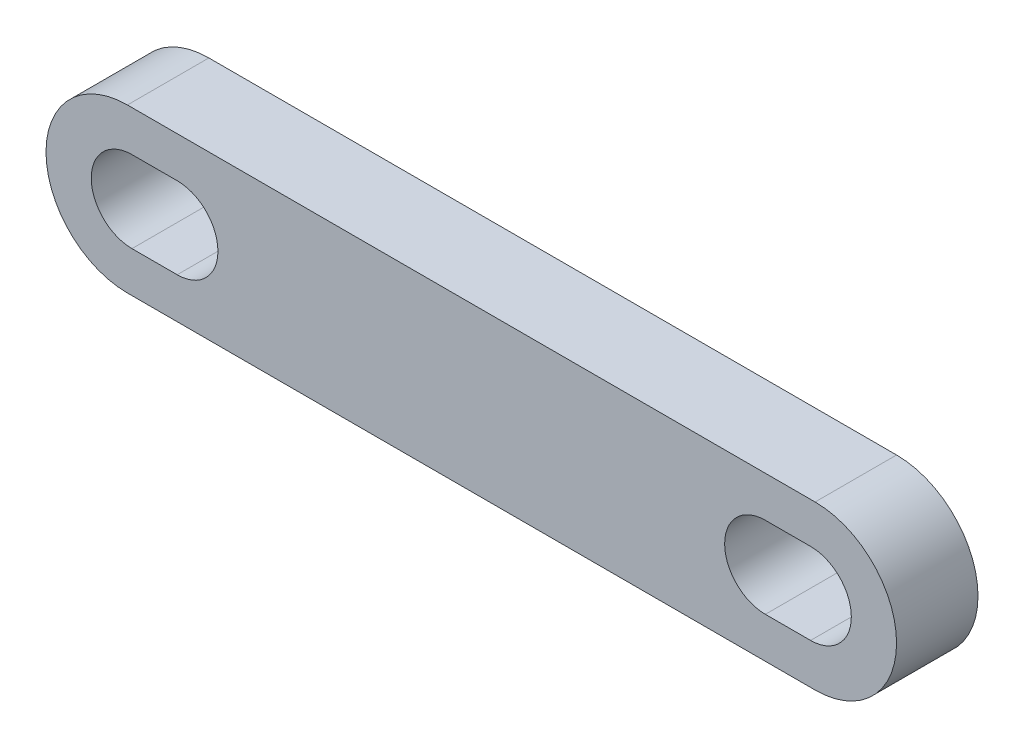
ISO-10303-21;
HEADER;
FILE_DESCRIPTION(('STEP AP214'),'2;1');
FILE_NAME('part.step','',(''),(''),'','','');
FILE_SCHEMA(('AUTOMOTIVE_DESIGN { 1 0 10303 214 1 1 1 1 }'));
ENDSEC;
DATA;
#1=APPLICATION_CONTEXT('core data for automotive mechanical design processes');
#2=APPLICATION_PROTOCOL_DEFINITION('international standard','automotive_design',2000,#1);
#3=PRODUCT_CONTEXT('',#1,'mechanical');
#4=PRODUCT('Part','Part','',(#3));
#5=PRODUCT_RELATED_PRODUCT_CATEGORY('part','',(#4));
#6=PRODUCT_DEFINITION_FORMATION('','',#4);
#7=PRODUCT_DEFINITION_CONTEXT('part definition',#1,'design');
#8=PRODUCT_DEFINITION('design','',#6,#7);
#9=PRODUCT_DEFINITION_SHAPE('','',#8);
#10=(LENGTH_UNIT() NAMED_UNIT(*) SI_UNIT(.MILLI.,.METRE.));
#11=(NAMED_UNIT(*) PLANE_ANGLE_UNIT() SI_UNIT($,.RADIAN.));
#12=(NAMED_UNIT(*) SI_UNIT($,.STERADIAN.) SOLID_ANGLE_UNIT());
#13=UNCERTAINTY_MEASURE_WITH_UNIT(LENGTH_MEASURE(1.E-05),#10,'distance_accuracy_value','');
#14=(GEOMETRIC_REPRESENTATION_CONTEXT(3) GLOBAL_UNCERTAINTY_ASSIGNED_CONTEXT((#13)) GLOBAL_UNIT_ASSIGNED_CONTEXT((#10,
#11,#12)) REPRESENTATION_CONTEXT('',''));
#15=CARTESIAN_POINT('',(0.,0.,0.));
#16=DIRECTION('',(0.,0.,1.));
#17=DIRECTION('',(1.,0.,0.));
#18=AXIS2_PLACEMENT_3D('',#15,#16,#17);
#19=CARTESIAN_POINT('',(-19.,-4.5,52.3539444560216));
#20=DIRECTION('',(0.,1.,0.));
#21=DIRECTION('',(-1.,0.,0.));
#22=AXIS2_PLACEMENT_3D('',#19,#20,#21);
#23=PLANE('',#22);
#24=DIRECTION('',(1.,0.,0.));
#25=VECTOR('',#24,1.);
#26=CARTESIAN_POINT('',(-19.,-4.5,4.49999999999997));
#27=LINE('',#26,#25);
#28=CARTESIAN_POINT('',(-19.,-4.5,4.49999999999997));
#29=VERTEX_POINT('',#28);
#30=CARTESIAN_POINT('',(19.,-4.5,4.49999999999997));
#31=VERTEX_POINT('',#30);
#32=EDGE_CURVE('E11',#29,#31,#27,.T.);
#33=ORIENTED_EDGE('',*,*,#32,.F.);
#34=DIRECTION('',(0.,0.,-1.));
#35=VECTOR('',#34,1.);
#36=CARTESIAN_POINT('',(-19.,-4.5,52.3539444560216));
#37=LINE('',#36,#35);
#38=CARTESIAN_POINT('',(-19.,-4.5,0.));
#39=VERTEX_POINT('',#38);
#40=EDGE_CURVE('E157',#29,#39,#37,.T.);
#41=ORIENTED_EDGE('',*,*,#40,.T.);
#42=DIRECTION('',(1.,0.,0.));
#43=VECTOR('',#42,1.);
#44=CARTESIAN_POINT('',(-19.,-4.5,0.));
#45=LINE('',#44,#43);
#46=CARTESIAN_POINT('',(19.,-4.5,0.));
#47=VERTEX_POINT('',#46);
#48=EDGE_CURVE('E151',#39,#47,#45,.T.);
#49=ORIENTED_EDGE('',*,*,#48,.T.);
#50=DIRECTION('',(0.,0.,-1.));
#51=VECTOR('',#50,1.);
#52=CARTESIAN_POINT('',(19.,-4.5,52.3539444560216));
#53=LINE('',#52,#51);
#54=EDGE_CURVE('E154',#31,#47,#53,.T.);
#55=ORIENTED_EDGE('',*,*,#54,.F.);
#56=EDGE_LOOP('',(#33,#41,#49,#55));
#57=FACE_BOUND('',#56,.T.);
#58=ADVANCED_FACE('F36',(#57),#23,.F.);
#59=CARTESIAN_POINT('',(-19.,0.,52.3539444560216));
#60=DIRECTION('',(0.,0.,-1.));
#61=DIRECTION('',(-1.,0.,0.));
#62=AXIS2_PLACEMENT_3D('',#59,#60,#61);
#63=CYLINDRICAL_SURFACE('',#62,4.5);
#64=CARTESIAN_POINT('',(-19.,0.,4.49999999999997));
#65=DIRECTION('',(0.,0.,1.));
#66=DIRECTION('',(1.,0.,0.));
#67=AXIS2_PLACEMENT_3D('',#64,#65,#66);
#68=CIRCLE('',#67,4.5);
#69=CARTESIAN_POINT('',(-19.,4.5,4.49999999999997));
#70=VERTEX_POINT('',#69);
#71=EDGE_CURVE('E200',#70,#29,#68,.T.);
#72=ORIENTED_EDGE('',*,*,#71,.F.);
#73=DIRECTION('',(0.,0.,-1.));
#74=VECTOR('',#73,1.);
#75=CARTESIAN_POINT('',(-19.,4.5,52.3539444560216));
#76=LINE('',#75,#74);
#77=CARTESIAN_POINT('',(-19.,4.5,0.));
#78=VERTEX_POINT('',#77);
#79=EDGE_CURVE('E160',#70,#78,#76,.T.);
#80=ORIENTED_EDGE('',*,*,#79,.T.);
#81=CARTESIAN_POINT('',(-19.,0.,0.));
#82=DIRECTION('',(0.,0.,1.));
#83=DIRECTION('',(1.,0.,0.));
#84=AXIS2_PLACEMENT_3D('',#81,#82,#83);
#85=CIRCLE('',#84,4.5);
#86=EDGE_CURVE('E148',#78,#39,#85,.T.);
#87=ORIENTED_EDGE('',*,*,#86,.T.);
#88=ORIENTED_EDGE('',*,*,#40,.F.);
#89=EDGE_LOOP('',(#72,#80,#87,#88));
#90=FACE_BOUND('',#89,.T.);
#91=ADVANCED_FACE('F203',(#90),#63,.T.);
#92=CARTESIAN_POINT('',(19.,4.5,52.3539444560216));
#93=DIRECTION('',(0.,-1.,0.));
#94=DIRECTION('',(1.,0.,0.));
#95=AXIS2_PLACEMENT_3D('',#92,#93,#94);
#96=PLANE('',#95);
#97=DIRECTION('',(-1.,0.,0.));
#98=VECTOR('',#97,1.);
#99=CARTESIAN_POINT('',(19.,4.5,4.49999999999996));
#100=LINE('',#99,#98);
#101=CARTESIAN_POINT('',(19.,4.5,4.49999999999996));
#102=VERTEX_POINT('',#101);
#103=EDGE_CURVE('E171',#102,#70,#100,.T.);
#104=ORIENTED_EDGE('',*,*,#103,.F.);
#105=DIRECTION('',(0.,0.,-1.));
#106=VECTOR('',#105,1.);
#107=CARTESIAN_POINT('',(19.,4.5,52.3539444560216));
#108=LINE('',#107,#106);
#109=CARTESIAN_POINT('',(19.,4.5,0.));
#110=VERTEX_POINT('',#109);
#111=EDGE_CURVE('E91',#102,#110,#108,.T.);
#112=ORIENTED_EDGE('',*,*,#111,.T.);
#113=DIRECTION('',(-1.,0.,0.));
#114=VECTOR('',#113,1.);
#115=CARTESIAN_POINT('',(19.,4.5,0.));
#116=LINE('',#115,#114);
#117=EDGE_CURVE('E145',#110,#78,#116,.T.);
#118=ORIENTED_EDGE('',*,*,#117,.T.);
#119=ORIENTED_EDGE('',*,*,#79,.F.);
#120=EDGE_LOOP('',(#104,#112,#118,#119));
#121=FACE_BOUND('',#120,.T.);
#122=ADVANCED_FACE('F167',(#121),#96,.F.);
#123=CARTESIAN_POINT('',(19.,0.,52.3539444560216));
#124=DIRECTION('',(0.,0.,-1.));
#125=DIRECTION('',(-1.,0.,0.));
#126=AXIS2_PLACEMENT_3D('',#123,#124,#125);
#127=CYLINDRICAL_SURFACE('',#126,4.5);
#128=CARTESIAN_POINT('',(19.,0.,4.49999999999996));
#129=DIRECTION('',(0.,0.,1.));
#130=DIRECTION('',(1.,0.,0.));
#131=AXIS2_PLACEMENT_3D('',#128,#129,#130);
#132=CIRCLE('',#131,4.5);
#133=EDGE_CURVE('E54',#31,#102,#132,.T.);
#134=ORIENTED_EDGE('',*,*,#133,.F.);
#135=ORIENTED_EDGE('',*,*,#54,.T.);
#136=CARTESIAN_POINT('',(19.,0.,0.));
#137=DIRECTION('',(0.,0.,1.));
#138=DIRECTION('',(1.,0.,0.));
#139=AXIS2_PLACEMENT_3D('',#136,#137,#138);
#140=CIRCLE('',#139,4.5);
#141=EDGE_CURVE('E142',#47,#110,#140,.T.);
#142=ORIENTED_EDGE('',*,*,#141,.T.);
#143=ORIENTED_EDGE('',*,*,#111,.F.);
#144=EDGE_LOOP('',(#134,#135,#142,#143));
#145=FACE_BOUND('',#144,.T.);
#146=ADVANCED_FACE('F38',(#145),#127,.T.);
#147=CARTESIAN_POINT('',(18.75,2.25,52.3539444560216));
#148=DIRECTION('',(0.,-1.,0.));
#149=DIRECTION('',(1.,0.,0.));
#150=AXIS2_PLACEMENT_3D('',#147,#148,#149);
#151=PLANE('',#150);
#152=DIRECTION('',(0.,0.,-1.));
#153=VECTOR('',#152,1.);
#154=CARTESIAN_POINT('',(18.75,2.25,52.3539444560216));
#155=LINE('',#154,#153);
#156=CARTESIAN_POINT('',(18.75,2.25,4.49999999999996));
#157=VERTEX_POINT('',#156);
#158=CARTESIAN_POINT('',(18.75,2.25,0.));
#159=VERTEX_POINT('',#158);
#160=EDGE_CURVE('E133',#157,#159,#155,.T.);
#161=ORIENTED_EDGE('',*,*,#160,.F.);
#162=DIRECTION('',(-1.,0.,0.));
#163=VECTOR('',#162,1.);
#164=CARTESIAN_POINT('',(18.75,2.25,4.49999999999996));
#165=LINE('',#164,#163);
#166=CARTESIAN_POINT('',(16.25,2.25,4.49999999999996));
#167=VERTEX_POINT('',#166);
#168=EDGE_CURVE('E90',#157,#167,#165,.T.);
#169=ORIENTED_EDGE('',*,*,#168,.T.);
#170=DIRECTION('',(0.,0.,-1.));
#171=VECTOR('',#170,1.);
#172=CARTESIAN_POINT('',(16.25,2.25,52.3539444560216));
#173=LINE('',#172,#171);
#174=CARTESIAN_POINT('',(16.25,2.25,0.));
#175=VERTEX_POINT('',#174);
#176=EDGE_CURVE('E130',#167,#175,#173,.T.);
#177=ORIENTED_EDGE('',*,*,#176,.T.);
#178=DIRECTION('',(-1.,0.,0.));
#179=VECTOR('',#178,1.);
#180=CARTESIAN_POINT('',(18.75,2.25,0.));
#181=LINE('',#180,#179);
#182=EDGE_CURVE('E127',#159,#175,#181,.T.);
#183=ORIENTED_EDGE('',*,*,#182,.F.);
#184=EDGE_LOOP('',(#161,#169,#177,#183));
#185=FACE_BOUND('',#184,.T.);
#186=ADVANCED_FACE('F226',(#185),#151,.T.);
#187=CARTESIAN_POINT('',(18.75,0.,52.3539444560216));
#188=DIRECTION('',(0.,0.,-1.));
#189=DIRECTION('',(-1.,0.,0.));
#190=AXIS2_PLACEMENT_3D('',#187,#188,#189);
#191=CYLINDRICAL_SURFACE('',#190,2.25);
#192=DIRECTION('',(0.,0.,-1.));
#193=VECTOR('',#192,1.);
#194=CARTESIAN_POINT('',(18.75,-2.25,52.3539444560216));
#195=LINE('',#194,#193);
#196=CARTESIAN_POINT('',(18.75,-2.25,4.49999999999996));
#197=VERTEX_POINT('',#196);
#198=CARTESIAN_POINT('',(18.75,-2.25,0.));
#199=VERTEX_POINT('',#198);
#200=EDGE_CURVE('E136',#197,#199,#195,.T.);
#201=ORIENTED_EDGE('',*,*,#200,.F.);
#202=CARTESIAN_POINT('',(18.75,0.,4.49999999999996));
#203=DIRECTION('',(0.,0.,1.));
#204=DIRECTION('',(1.,0.,0.));
#205=AXIS2_PLACEMENT_3D('',#202,#203,#204);
#206=CIRCLE('',#205,2.25);
#207=EDGE_CURVE('E46',#197,#157,#206,.T.);
#208=ORIENTED_EDGE('',*,*,#207,.T.);
#209=ORIENTED_EDGE('',*,*,#160,.T.);
#210=CARTESIAN_POINT('',(18.75,0.,0.));
#211=DIRECTION('',(0.,0.,1.));
#212=DIRECTION('',(1.,0.,0.));
#213=AXIS2_PLACEMENT_3D('',#210,#211,#212);
#214=CIRCLE('',#213,2.25);
#215=EDGE_CURVE('E124',#199,#159,#214,.T.);
#216=ORIENTED_EDGE('',*,*,#215,.F.);
#217=EDGE_LOOP('',(#201,#208,#209,#216));
#218=FACE_BOUND('',#217,.T.);
#219=ADVANCED_FACE('F222',(#218),#191,.F.);
#220=CARTESIAN_POINT('',(16.25,-2.25,52.3539444560216));
#221=DIRECTION('',(0.,1.,0.));
#222=DIRECTION('',(0.,0.,1.));
#223=AXIS2_PLACEMENT_3D('',#220,#221,#222);
#224=PLANE('',#223);
#225=DIRECTION('',(0.,0.,-1.));
#226=VECTOR('',#225,1.);
#227=CARTESIAN_POINT('',(16.25,-2.25,52.3539444560216));
#228=LINE('',#227,#226);
#229=CARTESIAN_POINT('',(16.25,-2.25,4.49999999999996));
#230=VERTEX_POINT('',#229);
#231=CARTESIAN_POINT('',(16.25,-2.25,0.));
#232=VERTEX_POINT('',#231);
#233=EDGE_CURVE('E139',#230,#232,#228,.T.);
#234=ORIENTED_EDGE('',*,*,#233,.F.);
#235=DIRECTION('',(1.,0.,0.));
#236=VECTOR('',#235,1.);
#237=CARTESIAN_POINT('',(16.25,-2.25,4.49999999999996));
#238=LINE('',#237,#236);
#239=EDGE_CURVE('E344',#230,#197,#238,.T.);
#240=ORIENTED_EDGE('',*,*,#239,.T.);
#241=ORIENTED_EDGE('',*,*,#200,.T.);
#242=DIRECTION('',(1.,0.,0.));
#243=VECTOR('',#242,1.);
#244=CARTESIAN_POINT('',(16.25,-2.25,0.));
#245=LINE('',#244,#243);
#246=EDGE_CURVE('E121',#232,#199,#245,.T.);
#247=ORIENTED_EDGE('',*,*,#246,.F.);
#248=EDGE_LOOP('',(#234,#240,#241,#247));
#249=FACE_BOUND('',#248,.T.);
#250=ADVANCED_FACE('F218',(#249),#224,.T.);
#251=CARTESIAN_POINT('',(16.25,0.,52.3539444560216));
#252=DIRECTION('',(0.,0.,-1.));
#253=DIRECTION('',(-1.,0.,0.));
#254=AXIS2_PLACEMENT_3D('',#251,#252,#253);
#255=CYLINDRICAL_SURFACE('',#254,2.25);
#256=ORIENTED_EDGE('',*,*,#176,.F.);
#257=CARTESIAN_POINT('',(16.25,0.,4.49999999999996));
#258=DIRECTION('',(0.,0.,1.));
#259=DIRECTION('',(1.,0.,0.));
#260=AXIS2_PLACEMENT_3D('',#257,#258,#259);
#261=CIRCLE('',#260,2.25);
#262=EDGE_CURVE('E102',#167,#230,#261,.T.);
#263=ORIENTED_EDGE('',*,*,#262,.T.);
#264=ORIENTED_EDGE('',*,*,#233,.T.);
#265=CARTESIAN_POINT('',(16.25,0.,0.));
#266=DIRECTION('',(0.,0.,1.));
#267=DIRECTION('',(1.,0.,0.));
#268=AXIS2_PLACEMENT_3D('',#265,#266,#267);
#269=CIRCLE('',#268,2.25);
#270=EDGE_CURVE('E118',#175,#232,#269,.T.);
#271=ORIENTED_EDGE('',*,*,#270,.F.);
#272=EDGE_LOOP('',(#256,#263,#264,#271));
#273=FACE_BOUND('',#272,.T.);
#274=ADVANCED_FACE('F214',(#273),#255,.F.);
#275=CARTESIAN_POINT('',(19.,0.,0.));
#276=DIRECTION('',(0.,0.,1.));
#277=DIRECTION('',(1.,0.,0.));
#278=AXIS2_PLACEMENT_3D('',#275,#276,#277);
#279=PLANE('',#278);
#280=ORIENTED_EDGE('',*,*,#270,.T.);
#281=ORIENTED_EDGE('',*,*,#246,.T.);
#282=ORIENTED_EDGE('',*,*,#215,.T.);
#283=ORIENTED_EDGE('',*,*,#182,.T.);
#284=EDGE_LOOP('',(#280,#281,#282,#283));
#285=FACE_BOUND('',#284,.T.);
#286=ORIENTED_EDGE('',*,*,#141,.F.);
#287=ORIENTED_EDGE('',*,*,#48,.F.);
#288=ORIENTED_EDGE('',*,*,#86,.F.);
#289=ORIENTED_EDGE('',*,*,#117,.F.);
#290=EDGE_LOOP('',(#286,#287,#288,#289));
#291=FACE_BOUND('',#290,.T.);
#292=CARTESIAN_POINT('',(-18.75,0.,0.));
#293=DIRECTION('',(0.,0.,1.));
#294=DIRECTION('',(1.,0.,0.));
#295=AXIS2_PLACEMENT_3D('',#292,#293,#294);
#296=CIRCLE('',#295,2.25);
#297=CARTESIAN_POINT('',(-18.75,2.25,0.));
#298=VERTEX_POINT('',#297);
#299=CARTESIAN_POINT('',(-18.75,-2.25,0.));
#300=VERTEX_POINT('',#299);
#301=EDGE_CURVE('E350',#298,#300,#296,.T.);
#302=ORIENTED_EDGE('',*,*,#301,.T.);
#303=DIRECTION('',(1.,0.,0.));
#304=VECTOR('',#303,1.);
#305=CARTESIAN_POINT('',(-18.75,-2.25,0.));
#306=LINE('',#305,#304);
#307=CARTESIAN_POINT('',(-16.25,-2.25,0.));
#308=VERTEX_POINT('',#307);
#309=EDGE_CURVE('E333',#300,#308,#306,.T.);
#310=ORIENTED_EDGE('',*,*,#309,.T.);
#311=CARTESIAN_POINT('',(-16.25,0.,0.));
#312=DIRECTION('',(0.,0.,1.));
#313=DIRECTION('',(1.,0.,0.));
#314=AXIS2_PLACEMENT_3D('',#311,#312,#313);
#315=CIRCLE('',#314,2.25);
#316=CARTESIAN_POINT('',(-16.25,2.25,0.));
#317=VERTEX_POINT('',#316);
#318=EDGE_CURVE('E353',#308,#317,#315,.T.);
#319=ORIENTED_EDGE('',*,*,#318,.T.);
#320=DIRECTION('',(-1.,0.,0.));
#321=VECTOR('',#320,1.);
#322=CARTESIAN_POINT('',(-16.25,2.25,0.));
#323=LINE('',#322,#321);
#324=EDGE_CURVE('E107',#317,#298,#323,.T.);
#325=ORIENTED_EDGE('',*,*,#324,.T.);
#326=EDGE_LOOP('',(#302,#310,#319,#325));
#327=FACE_BOUND('',#326,.T.);
#328=ADVANCED_FACE('F177',(#285,#291,#327),#279,.F.);
#329=CARTESIAN_POINT('',(-16.25,2.25,52.3539444560216));
#330=DIRECTION('',(0.,-1.,0.));
#331=DIRECTION('',(1.,0.,0.));
#332=AXIS2_PLACEMENT_3D('',#329,#330,#331);
#333=PLANE('',#332);
#334=DIRECTION('',(0.,0.,-1.));
#335=VECTOR('',#334,1.);
#336=CARTESIAN_POINT('',(-16.25,2.25,52.3539444560216));
#337=LINE('',#336,#335);
#338=CARTESIAN_POINT('',(-16.25,2.25,4.49999999999997));
#339=VERTEX_POINT('',#338);
#340=EDGE_CURVE('E97',#339,#317,#337,.T.);
#341=ORIENTED_EDGE('',*,*,#340,.F.);
#342=DIRECTION('',(-1.,0.,0.));
#343=VECTOR('',#342,1.);
#344=CARTESIAN_POINT('',(-16.25,2.25,4.49999999999997));
#345=LINE('',#344,#343);
#346=CARTESIAN_POINT('',(-18.75,2.25,4.49999999999997));
#347=VERTEX_POINT('',#346);
#348=EDGE_CURVE('E40',#339,#347,#345,.T.);
#349=ORIENTED_EDGE('',*,*,#348,.T.);
#350=DIRECTION('',(0.,0.,-1.));
#351=VECTOR('',#350,1.);
#352=CARTESIAN_POINT('',(-18.75,2.25,52.3539444560216));
#353=LINE('',#352,#351);
#354=EDGE_CURVE('E109',#347,#298,#353,.T.);
#355=ORIENTED_EDGE('',*,*,#354,.T.);
#356=ORIENTED_EDGE('',*,*,#324,.F.);
#357=EDGE_LOOP('',(#341,#349,#355,#356));
#358=FACE_BOUND('',#357,.T.);
#359=ADVANCED_FACE('F105',(#358),#333,.T.);
#360=CARTESIAN_POINT('',(-16.25,0.,52.3539444560216));
#361=DIRECTION('',(0.,0.,-1.));
#362=DIRECTION('',(-1.,0.,0.));
#363=AXIS2_PLACEMENT_3D('',#360,#361,#362);
#364=CYLINDRICAL_SURFACE('',#363,2.25);
#365=DIRECTION('',(0.,0.,-1.));
#366=VECTOR('',#365,1.);
#367=CARTESIAN_POINT('',(-16.25,-2.25,52.3539444560216));
#368=LINE('',#367,#366);
#369=CARTESIAN_POINT('',(-16.25,-2.25,4.49999999999997));
#370=VERTEX_POINT('',#369);
#371=EDGE_CURVE('E100',#370,#308,#368,.T.);
#372=ORIENTED_EDGE('',*,*,#371,.F.);
#373=CARTESIAN_POINT('',(-16.25,0.,4.49999999999997));
#374=DIRECTION('',(0.,0.,1.));
#375=DIRECTION('',(1.,0.,0.));
#376=AXIS2_PLACEMENT_3D('',#373,#374,#375);
#377=CIRCLE('',#376,2.25);
#378=EDGE_CURVE('E77',#370,#339,#377,.T.);
#379=ORIENTED_EDGE('',*,*,#378,.T.);
#380=ORIENTED_EDGE('',*,*,#340,.T.);
#381=ORIENTED_EDGE('',*,*,#318,.F.);
#382=EDGE_LOOP('',(#372,#379,#380,#381));
#383=FACE_BOUND('',#382,.T.);
#384=ADVANCED_FACE('F94',(#383),#364,.F.);
#385=CARTESIAN_POINT('',(-18.75,-2.25,52.3539444560216));
#386=DIRECTION('',(0.,1.,0.));
#387=DIRECTION('',(0.,0.,1.));
#388=AXIS2_PLACEMENT_3D('',#385,#386,#387);
#389=PLANE('',#388);
#390=DIRECTION('',(0.,0.,-1.));
#391=VECTOR('',#390,1.);
#392=CARTESIAN_POINT('',(-18.75,-2.25,52.3539444560216));
#393=LINE('',#392,#391);
#394=CARTESIAN_POINT('',(-18.75,-2.25,4.49999999999997));
#395=VERTEX_POINT('',#394);
#396=EDGE_CURVE('E111',#395,#300,#393,.T.);
#397=ORIENTED_EDGE('',*,*,#396,.F.);
#398=DIRECTION('',(1.,0.,0.));
#399=VECTOR('',#398,1.);
#400=CARTESIAN_POINT('',(-18.75,-2.25,4.49999999999997));
#401=LINE('',#400,#399);
#402=EDGE_CURVE('E103',#395,#370,#401,.T.);
#403=ORIENTED_EDGE('',*,*,#402,.T.);
#404=ORIENTED_EDGE('',*,*,#371,.T.);
#405=ORIENTED_EDGE('',*,*,#309,.F.);
#406=EDGE_LOOP('',(#397,#403,#404,#405));
#407=FACE_BOUND('',#406,.T.);
#408=ADVANCED_FACE('F234',(#407),#389,.T.);
#409=CARTESIAN_POINT('',(-18.75,0.,52.3539444560216));
#410=DIRECTION('',(0.,0.,-1.));
#411=DIRECTION('',(-1.,0.,0.));
#412=AXIS2_PLACEMENT_3D('',#409,#410,#411);
#413=CYLINDRICAL_SURFACE('',#412,2.25);
#414=ORIENTED_EDGE('',*,*,#354,.F.);
#415=CARTESIAN_POINT('',(-18.75,0.,4.49999999999997));
#416=DIRECTION('',(0.,0.,1.));
#417=DIRECTION('',(1.,0.,0.));
#418=AXIS2_PLACEMENT_3D('',#415,#416,#417);
#419=CIRCLE('',#418,2.25);
#420=EDGE_CURVE('E85',#347,#395,#419,.T.);
#421=ORIENTED_EDGE('',*,*,#420,.T.);
#422=ORIENTED_EDGE('',*,*,#396,.T.);
#423=ORIENTED_EDGE('',*,*,#301,.F.);
#424=EDGE_LOOP('',(#414,#421,#422,#423));
#425=FACE_BOUND('',#424,.T.);
#426=ADVANCED_FACE('F231',(#425),#413,.F.);
#427=CARTESIAN_POINT('',(-55.5292773671072,-329.7,4.49999999999998));
#428=DIRECTION('',(0.,0.,1.));
#429=DIRECTION('',(0.,1.,0.));
#430=AXIS2_PLACEMENT_3D('',#427,#428,#429);
#431=PLANE('',#430);
#432=ORIENTED_EDGE('',*,*,#348,.F.);
#433=ORIENTED_EDGE('',*,*,#378,.F.);
#434=ORIENTED_EDGE('',*,*,#402,.F.);
#435=ORIENTED_EDGE('',*,*,#420,.F.);
#436=EDGE_LOOP('',(#432,#433,#434,#435));
#437=FACE_BOUND('',#436,.T.);
#438=ORIENTED_EDGE('',*,*,#168,.F.);
#439=ORIENTED_EDGE('',*,*,#207,.F.);
#440=ORIENTED_EDGE('',*,*,#239,.F.);
#441=ORIENTED_EDGE('',*,*,#262,.F.);
#442=EDGE_LOOP('',(#438,#439,#440,#441));
#443=FACE_BOUND('',#442,.T.);
#444=ORIENTED_EDGE('',*,*,#133,.T.);
#445=ORIENTED_EDGE('',*,*,#103,.T.);
#446=ORIENTED_EDGE('',*,*,#71,.T.);
#447=ORIENTED_EDGE('',*,*,#32,.T.);
#448=EDGE_LOOP('',(#444,#445,#446,#447));
#449=FACE_BOUND('',#448,.T.);
#450=ADVANCED_FACE('F81',(#437,#443,#449),#431,.T.);
#451=CLOSED_SHELL('',(#58,#91,#122,#146,#186,#219,#250,#274,#328,#359,#384,#408,#426,#450));
#452=MANIFOLD_SOLID_BREP('B2',#451);
#453=ADVANCED_BREP_SHAPE_REPRESENTATION('',(#18,#452),#14);
#454=SHAPE_DEFINITION_REPRESENTATION(#9,#453);
ENDSEC;
END-ISO-10303-21;
